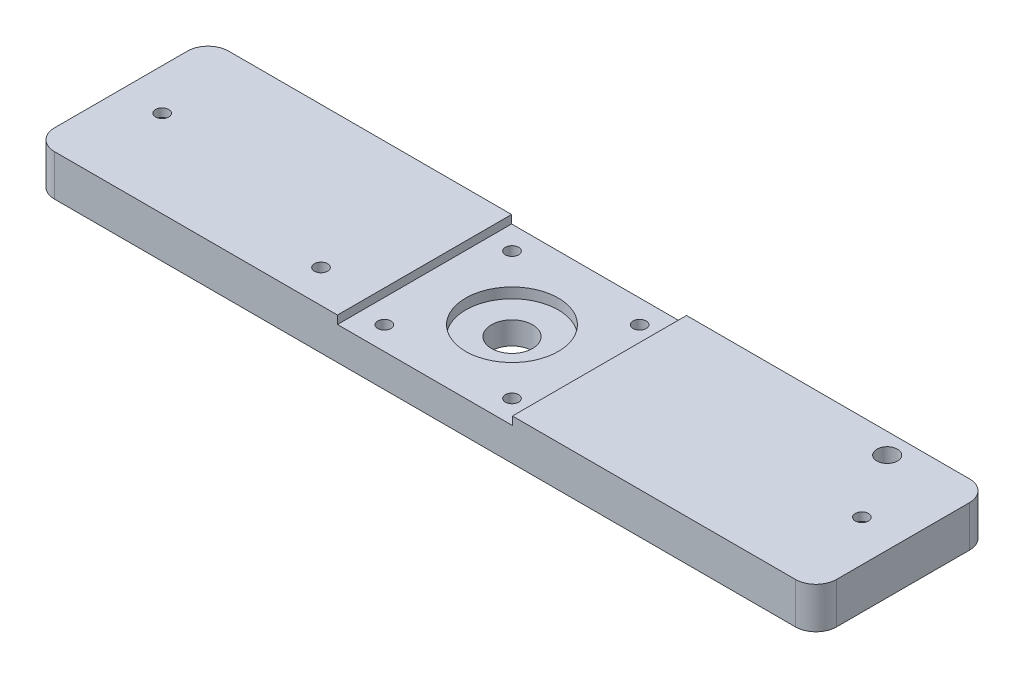
ISO-10303-21;
HEADER;
FILE_DESCRIPTION(('STEP AP214'),'2;1');
FILE_NAME('part.step','',(''),(''),'','','');
FILE_SCHEMA(('AUTOMOTIVE_DESIGN { 1 0 10303 214 1 1 1 1 }'));
ENDSEC;
DATA;
#1=APPLICATION_CONTEXT('core data for automotive mechanical design processes');
#2=APPLICATION_PROTOCOL_DEFINITION('international standard','automotive_design',2000,#1);
#3=PRODUCT_CONTEXT('',#1,'mechanical');
#4=PRODUCT('Part','Part','',(#3));
#5=PRODUCT_RELATED_PRODUCT_CATEGORY('part','',(#4));
#6=PRODUCT_DEFINITION_FORMATION('','',#4);
#7=PRODUCT_DEFINITION_CONTEXT('part definition',#1,'design');
#8=PRODUCT_DEFINITION('design','',#6,#7);
#9=PRODUCT_DEFINITION_SHAPE('','',#8);
#10=(LENGTH_UNIT() NAMED_UNIT(*) SI_UNIT(.MILLI.,.METRE.));
#11=(NAMED_UNIT(*) PLANE_ANGLE_UNIT() SI_UNIT($,.RADIAN.));
#12=(NAMED_UNIT(*) SI_UNIT($,.STERADIAN.) SOLID_ANGLE_UNIT());
#13=UNCERTAINTY_MEASURE_WITH_UNIT(LENGTH_MEASURE(1.E-05),#10,'distance_accuracy_value','');
#14=(GEOMETRIC_REPRESENTATION_CONTEXT(3) GLOBAL_UNCERTAINTY_ASSIGNED_CONTEXT((#13)) GLOBAL_UNIT_ASSIGNED_CONTEXT((#10,
#11,#12)) REPRESENTATION_CONTEXT('',''));
#15=CARTESIAN_POINT('',(0.,0.,0.));
#16=DIRECTION('',(0.,0.,1.));
#17=DIRECTION('',(1.,0.,0.));
#18=AXIS2_PLACEMENT_3D('',#15,#16,#17);
#19=CARTESIAN_POINT('',(0.,10.,0.));
#20=DIRECTION('',(0.,1.,0.));
#21=DIRECTION('',(0.,0.,1.));
#22=AXIS2_PLACEMENT_3D('',#19,#20,#21);
#23=PLANE('',#22);
#24=CARTESIAN_POINT('',(75.,10.,-16.15));
#25=DIRECTION('',(0.,1.,0.));
#26=DIRECTION('',(0.,0.,1.));
#27=AXIS2_PLACEMENT_3D('',#24,#25,#26);
#28=CIRCLE('',#27,2.50000000000001);
#29=CARTESIAN_POINT('',(75.,10.,-13.65));
#30=VERTEX_POINT('',#29);
#31=EDGE_CURVE('E383',#30,#30,#28,.T.);
#32=ORIENTED_EDGE('',*,*,#31,.F.);
#33=EDGE_LOOP('',(#32));
#34=FACE_BOUND('',#33,.T.);
#35=CARTESIAN_POINT('',(85.,10.,0.));
#36=DIRECTION('',(0.,-1.,0.));
#37=DIRECTION('',(0.,0.,-1.));
#38=AXIS2_PLACEMENT_3D('',#35,#36,#37);
#39=CIRCLE('',#38,1.60000000000001);
#40=CARTESIAN_POINT('',(85.,10.,-1.60000000000001));
#41=VERTEX_POINT('',#40);
#42=EDGE_CURVE('E347',#41,#41,#39,.T.);
#43=ORIENTED_EDGE('',*,*,#42,.T.);
#44=EDGE_LOOP('',(#43));
#45=FACE_BOUND('',#44,.T.);
#46=DIRECTION('',(0.,0.,-1.));
#47=VECTOR('',#46,1.);
#48=CARTESIAN_POINT('',(95.,10.,-21.15));
#49=LINE('',#48,#47);
#50=CARTESIAN_POINT('',(95.,10.,16.15));
#51=VERTEX_POINT('',#50);
#52=CARTESIAN_POINT('',(95.,10.,-16.15));
#53=VERTEX_POINT('',#52);
#54=EDGE_CURVE('E178',#51,#53,#49,.T.);
#55=ORIENTED_EDGE('',*,*,#54,.T.);
#56=CARTESIAN_POINT('',(90.,10.,-16.15));
#57=DIRECTION('',(0.,1.,0.));
#58=DIRECTION('',(0.,0.,1.));
#59=AXIS2_PLACEMENT_3D('',#56,#57,#58);
#60=CIRCLE('',#59,5.);
#61=CARTESIAN_POINT('',(90.,10.,-21.15));
#62=VERTEX_POINT('',#61);
#63=EDGE_CURVE('E236',#53,#62,#60,.T.);
#64=ORIENTED_EDGE('',*,*,#63,.T.);
#65=DIRECTION('',(-1.,0.,0.));
#66=VECTOR('',#65,1.);
#67=CARTESIAN_POINT('',(-95.,10.,-21.15));
#68=LINE('',#67,#66);
#69=CARTESIAN_POINT('',(21.25,10.,-21.15));
#70=VERTEX_POINT('',#69);
#71=EDGE_CURVE('E184',#62,#70,#68,.T.);
#72=ORIENTED_EDGE('',*,*,#71,.T.);
#73=DIRECTION('',(0.,0.,-1.));
#74=VECTOR('',#73,1.);
#75=CARTESIAN_POINT('',(21.25,10.,0.));
#76=LINE('',#75,#74);
#77=CARTESIAN_POINT('',(21.25,10.,21.15));
#78=VERTEX_POINT('',#77);
#79=EDGE_CURVE('E150',#78,#70,#76,.T.);
#80=ORIENTED_EDGE('',*,*,#79,.F.);
#81=DIRECTION('',(1.,0.,0.));
#82=VECTOR('',#81,1.);
#83=CARTESIAN_POINT('',(-95.,10.,21.15));
#84=LINE('',#83,#82);
#85=CARTESIAN_POINT('',(90.,10.,21.15));
#86=VERTEX_POINT('',#85);
#87=EDGE_CURVE('E140',#78,#86,#84,.T.);
#88=ORIENTED_EDGE('',*,*,#87,.T.);
#89=CARTESIAN_POINT('',(90.,10.,16.15));
#90=DIRECTION('',(0.,1.,0.));
#91=DIRECTION('',(0.,0.,1.));
#92=AXIS2_PLACEMENT_3D('',#89,#90,#91);
#93=CIRCLE('',#92,5.);
#94=EDGE_CURVE('E233',#86,#51,#93,.T.);
#95=ORIENTED_EDGE('',*,*,#94,.T.);
#96=EDGE_LOOP('',(#55,#64,#72,#80,#88,#95));
#97=FACE_BOUND('',#96,.T.);
#98=ADVANCED_FACE('F40',(#34,#45,#97),#23,.T.);
#99=CARTESIAN_POINT('',(95.,10.,-21.15));
#100=DIRECTION('',(-1.,0.,0.));
#101=DIRECTION('',(0.,0.,1.));
#102=AXIS2_PLACEMENT_3D('',#99,#100,#101);
#103=PLANE('',#102);
#104=DIRECTION('',(0.,0.,-1.));
#105=VECTOR('',#104,1.);
#106=CARTESIAN_POINT('',(95.,0.,-21.15));
#107=LINE('',#106,#105);
#108=CARTESIAN_POINT('',(95.,0.,16.15));
#109=VERTEX_POINT('',#108);
#110=CARTESIAN_POINT('',(95.,0.,-16.15));
#111=VERTEX_POINT('',#110);
#112=EDGE_CURVE('E177',#109,#111,#107,.T.);
#113=ORIENTED_EDGE('',*,*,#112,.T.);
#114=DIRECTION('',(0.,-1.,0.));
#115=VECTOR('',#114,1.);
#116=CARTESIAN_POINT('',(95.,10.,-16.15));
#117=LINE('',#116,#115);
#118=EDGE_CURVE('E230',#111,#53,#117,.F.);
#119=ORIENTED_EDGE('',*,*,#118,.T.);
#120=ORIENTED_EDGE('',*,*,#54,.F.);
#121=DIRECTION('',(0.,-1.,0.));
#122=VECTOR('',#121,1.);
#123=CARTESIAN_POINT('',(95.,10.,16.15));
#124=LINE('',#123,#122);
#125=EDGE_CURVE('E226',#51,#109,#124,.T.);
#126=ORIENTED_EDGE('',*,*,#125,.T.);
#127=EDGE_LOOP('',(#113,#119,#120,#126));
#128=FACE_BOUND('',#127,.T.);
#129=ADVANCED_FACE('F277',(#128),#103,.F.);
#130=CARTESIAN_POINT('',(-95.,10.,-21.15));
#131=DIRECTION('',(0.,0.,1.));
#132=DIRECTION('',(1.,0.,0.));
#133=AXIS2_PLACEMENT_3D('',#130,#131,#132);
#134=PLANE('',#133);
#135=ORIENTED_EDGE('',*,*,#71,.F.);
#136=DIRECTION('',(0.,-1.,0.));
#137=VECTOR('',#136,1.);
#138=CARTESIAN_POINT('',(90.,10.,-21.15));
#139=LINE('',#138,#137);
#140=CARTESIAN_POINT('',(90.,0.,-21.15));
#141=VERTEX_POINT('',#140);
#142=EDGE_CURVE('E210',#62,#141,#139,.T.);
#143=ORIENTED_EDGE('',*,*,#142,.T.);
#144=DIRECTION('',(-1.,0.,0.));
#145=VECTOR('',#144,1.);
#146=CARTESIAN_POINT('',(-95.,0.,-21.15));
#147=LINE('',#146,#145);
#148=CARTESIAN_POINT('',(-90.,0.,-21.15));
#149=VERTEX_POINT('',#148);
#150=EDGE_CURVE('E193',#141,#149,#147,.T.);
#151=ORIENTED_EDGE('',*,*,#150,.T.);
#152=DIRECTION('',(0.,-1.,0.));
#153=VECTOR('',#152,1.);
#154=CARTESIAN_POINT('',(-90.,10.,-21.15));
#155=LINE('',#154,#153);
#156=CARTESIAN_POINT('',(-90.,10.,-21.15));
#157=VERTEX_POINT('',#156);
#158=EDGE_CURVE('E207',#149,#157,#155,.F.);
#159=ORIENTED_EDGE('',*,*,#158,.T.);
#160=CARTESIAN_POINT('',(-21.25,10.,-21.15));
#161=VERTEX_POINT('',#160);
#162=EDGE_CURVE('E182',#161,#157,#68,.T.);
#163=ORIENTED_EDGE('',*,*,#162,.F.);
#164=DIRECTION('',(0.,-1.,0.));
#165=VECTOR('',#164,1.);
#166=CARTESIAN_POINT('',(-21.25,10.,-21.15));
#167=LINE('',#166,#165);
#168=CARTESIAN_POINT('',(-21.25,8.,-21.15));
#169=VERTEX_POINT('',#168);
#170=EDGE_CURVE('E148',#161,#169,#167,.T.);
#171=ORIENTED_EDGE('',*,*,#170,.T.);
#172=DIRECTION('',(-1.,0.,0.));
#173=VECTOR('',#172,1.);
#174=CARTESIAN_POINT('',(-95.,8.,-21.15));
#175=LINE('',#174,#173);
#176=CARTESIAN_POINT('',(21.25,8.,-21.15));
#177=VERTEX_POINT('',#176);
#178=EDGE_CURVE('E174',#177,#169,#175,.T.);
#179=ORIENTED_EDGE('',*,*,#178,.F.);
#180=DIRECTION('',(0.,1.,0.));
#181=VECTOR('',#180,1.);
#182=CARTESIAN_POINT('',(21.25,10.,-21.15));
#183=LINE('',#182,#181);
#184=EDGE_CURVE('E170',#177,#70,#183,.T.);
#185=ORIENTED_EDGE('',*,*,#184,.T.);
#186=EDGE_LOOP('',(#135,#143,#151,#159,#163,#171,#179,#185));
#187=FACE_BOUND('',#186,.T.);
#188=ADVANCED_FACE('F284',(#187),#134,.F.);
#189=CARTESIAN_POINT('',(-95.,10.,-21.15));
#190=DIRECTION('',(1.,0.,0.));
#191=DIRECTION('',(0.,0.,-1.));
#192=AXIS2_PLACEMENT_3D('',#189,#190,#191);
#193=PLANE('',#192);
#194=DIRECTION('',(0.,0.,1.));
#195=VECTOR('',#194,1.);
#196=CARTESIAN_POINT('',(-95.,0.,-21.15));
#197=LINE('',#196,#195);
#198=CARTESIAN_POINT('',(-95.,0.,-16.15));
#199=VERTEX_POINT('',#198);
#200=CARTESIAN_POINT('',(-95.,0.,16.15));
#201=VERTEX_POINT('',#200);
#202=EDGE_CURVE('E197',#199,#201,#197,.T.);
#203=ORIENTED_EDGE('',*,*,#202,.T.);
#204=DIRECTION('',(0.,-1.,0.));
#205=VECTOR('',#204,1.);
#206=CARTESIAN_POINT('',(-95.,10.,16.15));
#207=LINE('',#206,#205);
#208=CARTESIAN_POINT('',(-95.,10.,16.15));
#209=VERTEX_POINT('',#208);
#210=EDGE_CURVE('E56',#201,#209,#207,.F.);
#211=ORIENTED_EDGE('',*,*,#210,.T.);
#212=DIRECTION('',(0.,0.,1.));
#213=VECTOR('',#212,1.);
#214=CARTESIAN_POINT('',(-95.,10.,-21.15));
#215=LINE('',#214,#213);
#216=CARTESIAN_POINT('',(-95.,10.,-16.15));
#217=VERTEX_POINT('',#216);
#218=EDGE_CURVE('E187',#217,#209,#215,.T.);
#219=ORIENTED_EDGE('',*,*,#218,.F.);
#220=DIRECTION('',(0.,-1.,0.));
#221=VECTOR('',#220,1.);
#222=CARTESIAN_POINT('',(-95.,10.,-16.15));
#223=LINE('',#222,#221);
#224=EDGE_CURVE('E245',#217,#199,#223,.T.);
#225=ORIENTED_EDGE('',*,*,#224,.T.);
#226=EDGE_LOOP('',(#203,#211,#219,#225));
#227=FACE_BOUND('',#226,.T.);
#228=ADVANCED_FACE('F259',(#227),#193,.F.);
#229=CARTESIAN_POINT('',(-95.,10.,21.15));
#230=DIRECTION('',(0.,0.,-1.));
#231=DIRECTION('',(-1.,0.,0.));
#232=AXIS2_PLACEMENT_3D('',#229,#230,#231);
#233=PLANE('',#232);
#234=DIRECTION('',(1.,0.,0.));
#235=VECTOR('',#234,1.);
#236=CARTESIAN_POINT('',(-95.,0.,21.15));
#237=LINE('',#236,#235);
#238=CARTESIAN_POINT('',(-90.,0.,21.15));
#239=VERTEX_POINT('',#238);
#240=CARTESIAN_POINT('',(90.,0.,21.15));
#241=VERTEX_POINT('',#240);
#242=EDGE_CURVE('E183',#239,#241,#237,.T.);
#243=ORIENTED_EDGE('',*,*,#242,.T.);
#244=DIRECTION('',(0.,-1.,0.));
#245=VECTOR('',#244,1.);
#246=CARTESIAN_POINT('',(90.,10.,21.15));
#247=LINE('',#246,#245);
#248=EDGE_CURVE('E242',#241,#86,#247,.F.);
#249=ORIENTED_EDGE('',*,*,#248,.T.);
#250=ORIENTED_EDGE('',*,*,#87,.F.);
#251=DIRECTION('',(0.,-1.,0.));
#252=VECTOR('',#251,1.);
#253=CARTESIAN_POINT('',(21.25,10.,21.15));
#254=LINE('',#253,#252);
#255=CARTESIAN_POINT('',(21.25,8.,21.15));
#256=VERTEX_POINT('',#255);
#257=EDGE_CURVE('E162',#78,#256,#254,.T.);
#258=ORIENTED_EDGE('',*,*,#257,.T.);
#259=DIRECTION('',(1.,0.,0.));
#260=VECTOR('',#259,1.);
#261=CARTESIAN_POINT('',(-95.,8.,21.15));
#262=LINE('',#261,#260);
#263=CARTESIAN_POINT('',(-21.25,8.,21.15));
#264=VERTEX_POINT('',#263);
#265=EDGE_CURVE('E156',#264,#256,#262,.T.);
#266=ORIENTED_EDGE('',*,*,#265,.F.);
#267=DIRECTION('',(0.,1.,0.));
#268=VECTOR('',#267,1.);
#269=CARTESIAN_POINT('',(-21.25,10.,21.15));
#270=LINE('',#269,#268);
#271=CARTESIAN_POINT('',(-21.25,10.,21.15));
#272=VERTEX_POINT('',#271);
#273=EDGE_CURVE('E145',#264,#272,#270,.T.);
#274=ORIENTED_EDGE('',*,*,#273,.T.);
#275=CARTESIAN_POINT('',(-90.,10.,21.15));
#276=VERTEX_POINT('',#275);
#277=EDGE_CURVE('E129',#276,#272,#84,.T.);
#278=ORIENTED_EDGE('',*,*,#277,.F.);
#279=DIRECTION('',(0.,-1.,0.));
#280=VECTOR('',#279,1.);
#281=CARTESIAN_POINT('',(-90.,10.,21.15));
#282=LINE('',#281,#280);
#283=EDGE_CURVE('E239',#276,#239,#282,.T.);
#284=ORIENTED_EDGE('',*,*,#283,.T.);
#285=EDGE_LOOP('',(#243,#249,#250,#258,#266,#274,#278,#284));
#286=FACE_BOUND('',#285,.T.);
#287=ADVANCED_FACE('F154',(#286),#233,.F.);
#288=CARTESIAN_POINT('',(-33.25,10.,13.15));
#289=DIRECTION('',(0.,1.,0.));
#290=DIRECTION('',(0.,0.,1.));
#291=AXIS2_PLACEMENT_3D('',#288,#289,#290);
#292=CIRCLE('',#291,1.6);
#293=CARTESIAN_POINT('',(-33.25,10.,14.75));
#294=VERTEX_POINT('',#293);
#295=EDGE_CURVE('E378',#294,#294,#292,.T.);
#296=ORIENTED_EDGE('',*,*,#295,.F.);
#297=EDGE_LOOP('',(#296));
#298=FACE_BOUND('',#297,.T.);
#299=CARTESIAN_POINT('',(-85.,10.,0.));
#300=DIRECTION('',(0.,-1.,0.));
#301=DIRECTION('',(0.,0.,-1.));
#302=AXIS2_PLACEMENT_3D('',#299,#300,#301);
#303=CIRCLE('',#302,1.60000000000001);
#304=CARTESIAN_POINT('',(-85.,10.,-1.60000000000001));
#305=VERTEX_POINT('',#304);
#306=EDGE_CURVE('E332',#305,#305,#303,.T.);
#307=ORIENTED_EDGE('',*,*,#306,.T.);
#308=EDGE_LOOP('',(#307));
#309=FACE_BOUND('',#308,.T.);
#310=ORIENTED_EDGE('',*,*,#218,.T.);
#311=CARTESIAN_POINT('',(-90.,10.,16.15));
#312=DIRECTION('',(0.,1.,0.));
#313=DIRECTION('',(0.,0.,1.));
#314=AXIS2_PLACEMENT_3D('',#311,#312,#313);
#315=CIRCLE('',#314,5.);
#316=EDGE_CURVE('E11',#209,#276,#315,.T.);
#317=ORIENTED_EDGE('',*,*,#316,.T.);
#318=ORIENTED_EDGE('',*,*,#277,.T.);
#319=DIRECTION('',(0.,0.,1.));
#320=VECTOR('',#319,1.);
#321=CARTESIAN_POINT('',(-21.25,10.,0.));
#322=LINE('',#321,#320);
#323=EDGE_CURVE('E132',#161,#272,#322,.T.);
#324=ORIENTED_EDGE('',*,*,#323,.F.);
#325=ORIENTED_EDGE('',*,*,#162,.T.);
#326=CARTESIAN_POINT('',(-90.,10.,-16.15));
#327=DIRECTION('',(0.,1.,0.));
#328=DIRECTION('',(0.,0.,1.));
#329=AXIS2_PLACEMENT_3D('',#326,#327,#328);
#330=CIRCLE('',#329,5.);
#331=EDGE_CURVE('E49',#157,#217,#330,.T.);
#332=ORIENTED_EDGE('',*,*,#331,.T.);
#333=EDGE_LOOP('',(#310,#317,#318,#324,#325,#332));
#334=FACE_BOUND('',#333,.T.);
#335=ADVANCED_FACE('F131',(#298,#309,#334),#23,.T.);
#336=CARTESIAN_POINT('',(0.,0.,0.));
#337=DIRECTION('',(0.,1.,0.));
#338=DIRECTION('',(0.,0.,1.));
#339=AXIS2_PLACEMENT_3D('',#336,#337,#338);
#340=PLANE('',#339);
#341=CARTESIAN_POINT('',(75.,0.,-16.15));
#342=DIRECTION('',(0.,1.,0.));
#343=DIRECTION('',(0.,0.,1.));
#344=AXIS2_PLACEMENT_3D('',#341,#342,#343);
#345=CIRCLE('',#344,2.50000000000001);
#346=CARTESIAN_POINT('',(75.,0.,-13.65));
#347=VERTEX_POINT('',#346);
#348=EDGE_CURVE('E382',#347,#347,#345,.T.);
#349=ORIENTED_EDGE('',*,*,#348,.T.);
#350=EDGE_LOOP('',(#349));
#351=FACE_BOUND('',#350,.T.);
#352=CARTESIAN_POINT('',(-33.25,0.,13.15));
#353=DIRECTION('',(0.,1.,0.));
#354=DIRECTION('',(0.,0.,1.));
#355=AXIS2_PLACEMENT_3D('',#352,#353,#354);
#356=CIRCLE('',#355,1.6);
#357=CARTESIAN_POINT('',(-33.25,0.,14.75));
#358=VERTEX_POINT('',#357);
#359=EDGE_CURVE('E368',#358,#358,#356,.F.);
#360=ORIENTED_EDGE('',*,*,#359,.F.);
#361=EDGE_LOOP('',(#360));
#362=FACE_BOUND('',#361,.T.);
#363=CARTESIAN_POINT('',(-15.5,0.,-15.5));
#364=DIRECTION('',(0.,1.,0.));
#365=DIRECTION('',(0.,0.,1.));
#366=AXIS2_PLACEMENT_3D('',#363,#364,#365);
#367=CIRCLE('',#366,1.6);
#368=CARTESIAN_POINT('',(-15.5,0.,-13.9));
#369=VERTEX_POINT('',#368);
#370=EDGE_CURVE('E363',#369,#369,#367,.T.);
#371=ORIENTED_EDGE('',*,*,#370,.T.);
#372=EDGE_LOOP('',(#371));
#373=FACE_BOUND('',#372,.T.);
#374=CARTESIAN_POINT('',(-15.5,0.,15.5));
#375=DIRECTION('',(0.,1.,0.));
#376=DIRECTION('',(0.,0.,1.));
#377=AXIS2_PLACEMENT_3D('',#374,#375,#376);
#378=CIRCLE('',#377,1.6);
#379=CARTESIAN_POINT('',(-15.5,0.,17.1));
#380=VERTEX_POINT('',#379);
#381=EDGE_CURVE('E367',#380,#380,#378,.T.);
#382=ORIENTED_EDGE('',*,*,#381,.T.);
#383=EDGE_LOOP('',(#382));
#384=FACE_BOUND('',#383,.T.);
#385=CARTESIAN_POINT('',(15.5,0.,15.5));
#386=DIRECTION('',(0.,1.,0.));
#387=DIRECTION('',(0.,0.,1.));
#388=AXIS2_PLACEMENT_3D('',#385,#386,#387);
#389=CIRCLE('',#388,1.6);
#390=CARTESIAN_POINT('',(15.5,0.,17.1));
#391=VERTEX_POINT('',#390);
#392=EDGE_CURVE('E362',#391,#391,#389,.T.);
#393=ORIENTED_EDGE('',*,*,#392,.T.);
#394=EDGE_LOOP('',(#393));
#395=FACE_BOUND('',#394,.T.);
#396=CARTESIAN_POINT('',(15.5,0.,-15.5));
#397=DIRECTION('',(0.,1.,0.));
#398=DIRECTION('',(0.,0.,1.));
#399=AXIS2_PLACEMENT_3D('',#396,#397,#398);
#400=CIRCLE('',#399,1.6);
#401=CARTESIAN_POINT('',(15.5,0.,-13.9));
#402=VERTEX_POINT('',#401);
#403=EDGE_CURVE('E355',#402,#402,#400,.T.);
#404=ORIENTED_EDGE('',*,*,#403,.T.);
#405=EDGE_LOOP('',(#404));
#406=FACE_BOUND('',#405,.T.);
#407=CARTESIAN_POINT('',(-85.,0.,0.));
#408=DIRECTION('',(0.,-1.,0.));
#409=DIRECTION('',(0.,0.,-1.));
#410=AXIS2_PLACEMENT_3D('',#407,#408,#409);
#411=CIRCLE('',#410,4.025);
#412=CARTESIAN_POINT('',(-85.,0.,-4.025));
#413=VERTEX_POINT('',#412);
#414=EDGE_CURVE('E336',#413,#413,#411,.T.);
#415=ORIENTED_EDGE('',*,*,#414,.F.);
#416=EDGE_LOOP('',(#415));
#417=FACE_BOUND('',#416,.T.);
#418=CARTESIAN_POINT('',(85.,0.,0.));
#419=DIRECTION('',(0.,-1.,0.));
#420=DIRECTION('',(0.,0.,1.));
#421=AXIS2_PLACEMENT_3D('',#418,#419,#420);
#422=CIRCLE('',#421,4.025);
#423=CARTESIAN_POINT('',(85.,0.,4.025));
#424=VERTEX_POINT('',#423);
#425=EDGE_CURVE('E327',#424,#424,#422,.T.);
#426=ORIENTED_EDGE('',*,*,#425,.F.);
#427=EDGE_LOOP('',(#426));
#428=FACE_BOUND('',#427,.T.);
#429=CARTESIAN_POINT('',(0.,0.,0.));
#430=DIRECTION('',(0.,1.,0.));
#431=DIRECTION('',(0.,0.,1.));
#432=AXIS2_PLACEMENT_3D('',#429,#430,#431);
#433=CIRCLE('',#432,5.);
#434=CARTESIAN_POINT('',(0.,0.,5.));
#435=VERTEX_POINT('',#434);
#436=EDGE_CURVE('E304',#435,#435,#433,.T.);
#437=ORIENTED_EDGE('',*,*,#436,.T.);
#438=EDGE_LOOP('',(#437));
#439=FACE_BOUND('',#438,.T.);
#440=ORIENTED_EDGE('',*,*,#150,.F.);
#441=CARTESIAN_POINT('',(90.,0.,-16.15));
#442=DIRECTION('',(0.,1.,0.));
#443=DIRECTION('',(0.,0.,1.));
#444=AXIS2_PLACEMENT_3D('',#441,#442,#443);
#445=CIRCLE('',#444,5.);
#446=EDGE_CURVE('E223',#141,#111,#445,.F.);
#447=ORIENTED_EDGE('',*,*,#446,.T.);
#448=ORIENTED_EDGE('',*,*,#112,.F.);
#449=CARTESIAN_POINT('',(90.,0.,16.15));
#450=DIRECTION('',(0.,1.,0.));
#451=DIRECTION('',(0.,0.,1.));
#452=AXIS2_PLACEMENT_3D('',#449,#450,#451);
#453=CIRCLE('',#452,5.);
#454=EDGE_CURVE('E220',#109,#241,#453,.F.);
#455=ORIENTED_EDGE('',*,*,#454,.T.);
#456=ORIENTED_EDGE('',*,*,#242,.F.);
#457=CARTESIAN_POINT('',(-90.,0.,16.15));
#458=DIRECTION('',(0.,1.,0.));
#459=DIRECTION('',(0.,0.,1.));
#460=AXIS2_PLACEMENT_3D('',#457,#458,#459);
#461=CIRCLE('',#460,5.);
#462=EDGE_CURVE('E217',#239,#201,#461,.F.);
#463=ORIENTED_EDGE('',*,*,#462,.T.);
#464=ORIENTED_EDGE('',*,*,#202,.F.);
#465=CARTESIAN_POINT('',(-90.,0.,-16.15));
#466=DIRECTION('',(0.,1.,0.));
#467=DIRECTION('',(0.,0.,1.));
#468=AXIS2_PLACEMENT_3D('',#465,#466,#467);
#469=CIRCLE('',#468,5.);
#470=EDGE_CURVE('E214',#199,#149,#469,.F.);
#471=ORIENTED_EDGE('',*,*,#470,.T.);
#472=EDGE_LOOP('',(#440,#447,#448,#455,#456,#463,#464,#471));
#473=FACE_BOUND('',#472,.T.);
#474=ADVANCED_FACE('F262',(#351,#362,#373,#384,#395,#406,#417,#428,#439,#473),#340,.F.);
#475=CARTESIAN_POINT('',(0.,8.,0.));
#476=DIRECTION('',(0.,1.,0.));
#477=DIRECTION('',(0.,0.,1.));
#478=AXIS2_PLACEMENT_3D('',#475,#476,#477);
#479=PLANE('',#478);
#480=CARTESIAN_POINT('',(0.,8.,0.));
#481=DIRECTION('',(0.,1.,0.));
#482=DIRECTION('',(0.,0.,1.));
#483=AXIS2_PLACEMENT_3D('',#480,#481,#482);
#484=CIRCLE('',#483,11.25);
#485=CARTESIAN_POINT('',(0.,8.,11.25));
#486=VERTEX_POINT('',#485);
#487=EDGE_CURVE('E299',#486,#486,#484,.T.);
#488=ORIENTED_EDGE('',*,*,#487,.F.);
#489=EDGE_LOOP('',(#488));
#490=FACE_BOUND('',#489,.T.);
#491=CARTESIAN_POINT('',(-15.5,8.,15.5));
#492=DIRECTION('',(0.,1.,0.));
#493=DIRECTION('',(0.,0.,-1.));
#494=AXIS2_PLACEMENT_3D('',#491,#492,#493);
#495=CIRCLE('',#494,1.6);
#496=CARTESIAN_POINT('',(-15.5,8.,13.9));
#497=VERTEX_POINT('',#496);
#498=EDGE_CURVE('E308',#497,#497,#495,.T.);
#499=ORIENTED_EDGE('',*,*,#498,.F.);
#500=EDGE_LOOP('',(#499));
#501=FACE_BOUND('',#500,.T.);
#502=CARTESIAN_POINT('',(15.5,8.,15.5));
#503=DIRECTION('',(0.,1.,0.));
#504=DIRECTION('',(0.,0.,1.));
#505=AXIS2_PLACEMENT_3D('',#502,#503,#504);
#506=CIRCLE('',#505,1.6);
#507=CARTESIAN_POINT('',(15.5,8.,17.1));
#508=VERTEX_POINT('',#507);
#509=EDGE_CURVE('E312',#508,#508,#506,.T.);
#510=ORIENTED_EDGE('',*,*,#509,.F.);
#511=EDGE_LOOP('',(#510));
#512=FACE_BOUND('',#511,.T.);
#513=CARTESIAN_POINT('',(15.5,8.,-15.5));
#514=DIRECTION('',(0.,1.,0.));
#515=DIRECTION('',(0.,0.,-1.));
#516=AXIS2_PLACEMENT_3D('',#513,#514,#515);
#517=CIRCLE('',#516,1.6);
#518=CARTESIAN_POINT('',(15.5,8.,-17.1));
#519=VERTEX_POINT('',#518);
#520=EDGE_CURVE('E296',#519,#519,#517,.T.);
#521=ORIENTED_EDGE('',*,*,#520,.F.);
#522=EDGE_LOOP('',(#521));
#523=FACE_BOUND('',#522,.T.);
#524=CARTESIAN_POINT('',(-15.5,8.,-15.5));
#525=DIRECTION('',(0.,1.,0.));
#526=DIRECTION('',(0.,0.,1.));
#527=AXIS2_PLACEMENT_3D('',#524,#525,#526);
#528=CIRCLE('',#527,1.6);
#529=CARTESIAN_POINT('',(-15.5,8.,-13.9));
#530=VERTEX_POINT('',#529);
#531=EDGE_CURVE('E293',#530,#530,#528,.T.);
#532=ORIENTED_EDGE('',*,*,#531,.F.);
#533=EDGE_LOOP('',(#532));
#534=FACE_BOUND('',#533,.T.);
#535=ORIENTED_EDGE('',*,*,#178,.T.);
#536=DIRECTION('',(0.,0.,1.));
#537=VECTOR('',#536,1.);
#538=CARTESIAN_POINT('',(-21.25,8.,-24.8385682721788));
#539=LINE('',#538,#537);
#540=EDGE_CURVE('E158',#169,#264,#539,.T.);
#541=ORIENTED_EDGE('',*,*,#540,.T.);
#542=ORIENTED_EDGE('',*,*,#265,.T.);
#543=DIRECTION('',(0.,0.,-1.));
#544=VECTOR('',#543,1.);
#545=CARTESIAN_POINT('',(21.25,8.,-24.8385682721788));
#546=LINE('',#545,#544);
#547=EDGE_CURVE('E164',#256,#177,#546,.T.);
#548=ORIENTED_EDGE('',*,*,#547,.T.);
#549=EDGE_LOOP('',(#535,#541,#542,#548));
#550=FACE_BOUND('',#549,.T.);
#551=ADVANCED_FACE('F291',(#490,#501,#512,#523,#534,#550),#479,.T.);
#552=CARTESIAN_POINT('',(21.25,8.,-24.8385682721788));
#553=DIRECTION('',(1.,0.,0.));
#554=DIRECTION('',(0.,0.,-1.));
#555=AXIS2_PLACEMENT_3D('',#552,#553,#554);
#556=PLANE('',#555);
#557=ORIENTED_EDGE('',*,*,#547,.F.);
#558=ORIENTED_EDGE('',*,*,#257,.F.);
#559=ORIENTED_EDGE('',*,*,#79,.T.);
#560=ORIENTED_EDGE('',*,*,#184,.F.);
#561=EDGE_LOOP('',(#557,#558,#559,#560));
#562=FACE_BOUND('',#561,.T.);
#563=ADVANCED_FACE('F289',(#562),#556,.F.);
#564=CARTESIAN_POINT('',(-21.25,8.,-24.8385682721788));
#565=DIRECTION('',(-1.,0.,0.));
#566=DIRECTION('',(0.,0.,1.));
#567=AXIS2_PLACEMENT_3D('',#564,#565,#566);
#568=PLANE('',#567);
#569=ORIENTED_EDGE('',*,*,#323,.T.);
#570=ORIENTED_EDGE('',*,*,#273,.F.);
#571=ORIENTED_EDGE('',*,*,#540,.F.);
#572=ORIENTED_EDGE('',*,*,#170,.F.);
#573=EDGE_LOOP('',(#569,#570,#571,#572));
#574=FACE_BOUND('',#573,.T.);
#575=ADVANCED_FACE('F143',(#574),#568,.F.);
#576=CARTESIAN_POINT('',(-15.5,5.5,-15.5));
#577=DIRECTION('',(0.,1.,0.));
#578=DIRECTION('',(0.,0.,1.));
#579=AXIS2_PLACEMENT_3D('',#576,#577,#578);
#580=CYLINDRICAL_SURFACE('',#579,1.6);
#581=ORIENTED_EDGE('',*,*,#531,.T.);
#582=EDGE_LOOP('',(#581));
#583=FACE_BOUND('',#582,.T.);
#584=ORIENTED_EDGE('',*,*,#370,.F.);
#585=EDGE_LOOP('',(#584));
#586=FACE_BOUND('',#585,.T.);
#587=ADVANCED_FACE('F460',(#583,#586),#580,.F.);
#588=CARTESIAN_POINT('',(15.5,5.5,-15.5));
#589=DIRECTION('',(0.,1.,0.));
#590=DIRECTION('',(0.,0.,1.));
#591=AXIS2_PLACEMENT_3D('',#588,#589,#590);
#592=CYLINDRICAL_SURFACE('',#591,1.6);
#593=ORIENTED_EDGE('',*,*,#520,.T.);
#594=EDGE_LOOP('',(#593));
#595=FACE_BOUND('',#594,.T.);
#596=ORIENTED_EDGE('',*,*,#403,.F.);
#597=EDGE_LOOP('',(#596));
#598=FACE_BOUND('',#597,.T.);
#599=ADVANCED_FACE('F463',(#595,#598),#592,.F.);
#600=CARTESIAN_POINT('',(15.5,5.5,15.5));
#601=DIRECTION('',(0.,1.,0.));
#602=DIRECTION('',(0.,0.,1.));
#603=AXIS2_PLACEMENT_3D('',#600,#601,#602);
#604=CYLINDRICAL_SURFACE('',#603,1.6);
#605=ORIENTED_EDGE('',*,*,#509,.T.);
#606=EDGE_LOOP('',(#605));
#607=FACE_BOUND('',#606,.T.);
#608=ORIENTED_EDGE('',*,*,#392,.F.);
#609=EDGE_LOOP('',(#608));
#610=FACE_BOUND('',#609,.T.);
#611=ADVANCED_FACE('F490',(#607,#610),#604,.F.);
#612=CARTESIAN_POINT('',(-15.5,5.5,15.5));
#613=DIRECTION('',(0.,1.,0.));
#614=DIRECTION('',(0.,0.,1.));
#615=AXIS2_PLACEMENT_3D('',#612,#613,#614);
#616=CYLINDRICAL_SURFACE('',#615,1.6);
#617=ORIENTED_EDGE('',*,*,#498,.T.);
#618=EDGE_LOOP('',(#617));
#619=FACE_BOUND('',#618,.T.);
#620=ORIENTED_EDGE('',*,*,#381,.F.);
#621=EDGE_LOOP('',(#620));
#622=FACE_BOUND('',#621,.T.);
#623=ADVANCED_FACE('F445',(#619,#622),#616,.F.);
#624=CARTESIAN_POINT('',(0.,5.5,0.));
#625=DIRECTION('',(0.,1.,0.));
#626=DIRECTION('',(0.,0.,1.));
#627=AXIS2_PLACEMENT_3D('',#624,#625,#626);
#628=CYLINDRICAL_SURFACE('',#627,11.25);
#629=CARTESIAN_POINT('',(0.,5.5,0.));
#630=DIRECTION('',(0.,1.,0.));
#631=DIRECTION('',(0.,0.,1.));
#632=AXIS2_PLACEMENT_3D('',#629,#630,#631);
#633=CIRCLE('',#632,11.25);
#634=CARTESIAN_POINT('',(0.,5.5,11.25));
#635=VERTEX_POINT('',#634);
#636=EDGE_CURVE('E303',#635,#635,#633,.T.);
#637=ORIENTED_EDGE('',*,*,#636,.F.);
#638=EDGE_LOOP('',(#637));
#639=FACE_BOUND('',#638,.T.);
#640=ORIENTED_EDGE('',*,*,#487,.T.);
#641=EDGE_LOOP('',(#640));
#642=FACE_BOUND('',#641,.T.);
#643=ADVANCED_FACE('F439',(#639,#642),#628,.F.);
#644=CARTESIAN_POINT('',(0.,5.5,0.));
#645=DIRECTION('',(0.,1.,0.));
#646=DIRECTION('',(0.,0.,1.));
#647=AXIS2_PLACEMENT_3D('',#644,#645,#646);
#648=PLANE('',#647);
#649=CARTESIAN_POINT('',(0.,5.5,0.));
#650=DIRECTION('',(0.,1.,0.));
#651=DIRECTION('',(0.,0.,1.));
#652=AXIS2_PLACEMENT_3D('',#649,#650,#651);
#653=CIRCLE('',#652,5.);
#654=CARTESIAN_POINT('',(0.,5.5,5.));
#655=VERTEX_POINT('',#654);
#656=EDGE_CURVE('E319',#655,#655,#653,.T.);
#657=ORIENTED_EDGE('',*,*,#656,.F.);
#658=EDGE_LOOP('',(#657));
#659=FACE_BOUND('',#658,.T.);
#660=ORIENTED_EDGE('',*,*,#636,.T.);
#661=EDGE_LOOP('',(#660));
#662=FACE_BOUND('',#661,.T.);
#663=ADVANCED_FACE('F433',(#659,#662),#648,.T.);
#664=CARTESIAN_POINT('',(0.,0.,0.));
#665=DIRECTION('',(0.,1.,0.));
#666=DIRECTION('',(0.,0.,1.));
#667=AXIS2_PLACEMENT_3D('',#664,#665,#666);
#668=CYLINDRICAL_SURFACE('',#667,5.);
#669=ORIENTED_EDGE('',*,*,#436,.F.);
#670=EDGE_LOOP('',(#669));
#671=FACE_BOUND('',#670,.T.);
#672=ORIENTED_EDGE('',*,*,#656,.T.);
#673=EDGE_LOOP('',(#672));
#674=FACE_BOUND('',#673,.T.);
#675=ADVANCED_FACE('F422',(#671,#674),#668,.F.);
#676=CARTESIAN_POINT('',(85.,8.,0.));
#677=DIRECTION('',(0.,-1.,0.));
#678=DIRECTION('',(0.,0.,-1.));
#679=AXIS2_PLACEMENT_3D('',#676,#677,#678);
#680=CYLINDRICAL_SURFACE('',#679,4.025);
#681=CARTESIAN_POINT('',(85.,8.,0.));
#682=DIRECTION('',(0.,-1.,0.));
#683=DIRECTION('',(0.,0.,1.));
#684=AXIS2_PLACEMENT_3D('',#681,#682,#683);
#685=CIRCLE('',#684,4.025);
#686=CARTESIAN_POINT('',(85.,8.,4.025));
#687=VERTEX_POINT('',#686);
#688=EDGE_CURVE('E331',#687,#687,#685,.T.);
#689=ORIENTED_EDGE('',*,*,#688,.F.);
#690=EDGE_LOOP('',(#689));
#691=FACE_BOUND('',#690,.T.);
#692=ORIENTED_EDGE('',*,*,#425,.T.);
#693=EDGE_LOOP('',(#692));
#694=FACE_BOUND('',#693,.T.);
#695=ADVANCED_FACE('F416',(#691,#694),#680,.F.);
#696=CARTESIAN_POINT('',(85.,8.,0.));
#697=DIRECTION('',(0.,1.,0.));
#698=DIRECTION('',(0.,0.,1.));
#699=AXIS2_PLACEMENT_3D('',#696,#697,#698);
#700=PLANE('',#699);
#701=CARTESIAN_POINT('',(85.,8.,0.));
#702=DIRECTION('',(0.,-1.,0.));
#703=DIRECTION('',(0.,0.,-1.));
#704=AXIS2_PLACEMENT_3D('',#701,#702,#703);
#705=CIRCLE('',#704,1.60000000000001);
#706=CARTESIAN_POINT('',(85.,8.,-1.60000000000001));
#707=VERTEX_POINT('',#706);
#708=EDGE_CURVE('E351',#707,#707,#705,.T.);
#709=ORIENTED_EDGE('',*,*,#708,.F.);
#710=EDGE_LOOP('',(#709));
#711=FACE_BOUND('',#710,.T.);
#712=ORIENTED_EDGE('',*,*,#688,.T.);
#713=EDGE_LOOP('',(#712));
#714=FACE_BOUND('',#713,.T.);
#715=ADVANCED_FACE('F412',(#711,#714),#700,.F.);
#716=CARTESIAN_POINT('',(-85.,8.,0.));
#717=DIRECTION('',(0.,-1.,0.));
#718=DIRECTION('',(0.,0.,-1.));
#719=AXIS2_PLACEMENT_3D('',#716,#717,#718);
#720=CYLINDRICAL_SURFACE('',#719,4.025);
#721=CARTESIAN_POINT('',(-85.,8.,0.));
#722=DIRECTION('',(0.,-1.,0.));
#723=DIRECTION('',(0.,0.,-1.));
#724=AXIS2_PLACEMENT_3D('',#721,#722,#723);
#725=CIRCLE('',#724,4.025);
#726=CARTESIAN_POINT('',(-85.,8.,-4.025));
#727=VERTEX_POINT('',#726);
#728=EDGE_CURVE('E323',#727,#727,#725,.T.);
#729=ORIENTED_EDGE('',*,*,#728,.F.);
#730=EDGE_LOOP('',(#729));
#731=FACE_BOUND('',#730,.T.);
#732=ORIENTED_EDGE('',*,*,#414,.T.);
#733=EDGE_LOOP('',(#732));
#734=FACE_BOUND('',#733,.T.);
#735=ADVANCED_FACE('F415',(#731,#734),#720,.F.);
#736=CARTESIAN_POINT('',(-85.,8.,0.));
#737=DIRECTION('',(0.,-1.,0.));
#738=DIRECTION('',(0.,0.,-1.));
#739=AXIS2_PLACEMENT_3D('',#736,#737,#738);
#740=PLANE('',#739);
#741=CARTESIAN_POINT('',(-85.,8.,0.));
#742=DIRECTION('',(0.,-1.,0.));
#743=DIRECTION('',(0.,0.,-1.));
#744=AXIS2_PLACEMENT_3D('',#741,#742,#743);
#745=CIRCLE('',#744,1.60000000000001);
#746=CARTESIAN_POINT('',(-85.,8.,-1.60000000000001));
#747=VERTEX_POINT('',#746);
#748=EDGE_CURVE('E343',#747,#747,#745,.T.);
#749=ORIENTED_EDGE('',*,*,#748,.F.);
#750=EDGE_LOOP('',(#749));
#751=FACE_BOUND('',#750,.T.);
#752=ORIENTED_EDGE('',*,*,#728,.T.);
#753=EDGE_LOOP('',(#752));
#754=FACE_BOUND('',#753,.T.);
#755=ADVANCED_FACE('F477',(#751,#754),#740,.T.);
#756=CARTESIAN_POINT('',(-85.,10.,0.));
#757=DIRECTION('',(0.,-1.,0.));
#758=DIRECTION('',(0.,0.,-1.));
#759=AXIS2_PLACEMENT_3D('',#756,#757,#758);
#760=CYLINDRICAL_SURFACE('',#759,1.60000000000001);
#761=ORIENTED_EDGE('',*,*,#306,.F.);
#762=EDGE_LOOP('',(#761));
#763=FACE_BOUND('',#762,.T.);
#764=ORIENTED_EDGE('',*,*,#748,.T.);
#765=EDGE_LOOP('',(#764));
#766=FACE_BOUND('',#765,.T.);
#767=ADVANCED_FACE('F408',(#763,#766),#760,.F.);
#768=CARTESIAN_POINT('',(85.,10.,0.));
#769=DIRECTION('',(0.,-1.,0.));
#770=DIRECTION('',(0.,0.,-1.));
#771=AXIS2_PLACEMENT_3D('',#768,#769,#770);
#772=CYLINDRICAL_SURFACE('',#771,1.60000000000001);
#773=ORIENTED_EDGE('',*,*,#42,.F.);
#774=EDGE_LOOP('',(#773));
#775=FACE_BOUND('',#774,.T.);
#776=ORIENTED_EDGE('',*,*,#708,.T.);
#777=EDGE_LOOP('',(#776));
#778=FACE_BOUND('',#777,.T.);
#779=ADVANCED_FACE('F405',(#775,#778),#772,.F.);
#780=CARTESIAN_POINT('',(90.,10.,-16.15));
#781=DIRECTION('',(0.,-1.,0.));
#782=DIRECTION('',(0.,0.,-1.));
#783=AXIS2_PLACEMENT_3D('',#780,#781,#782);
#784=CYLINDRICAL_SURFACE('',#783,5.);
#785=ORIENTED_EDGE('',*,*,#63,.F.);
#786=ORIENTED_EDGE('',*,*,#118,.F.);
#787=ORIENTED_EDGE('',*,*,#446,.F.);
#788=ORIENTED_EDGE('',*,*,#142,.F.);
#789=EDGE_LOOP('',(#785,#786,#787,#788));
#790=FACE_BOUND('',#789,.T.);
#791=ADVANCED_FACE('F281',(#790),#784,.T.);
#792=CARTESIAN_POINT('',(90.,10.,16.15));
#793=DIRECTION('',(0.,-1.,0.));
#794=DIRECTION('',(0.,0.,-1.));
#795=AXIS2_PLACEMENT_3D('',#792,#793,#794);
#796=CYLINDRICAL_SURFACE('',#795,5.);
#797=ORIENTED_EDGE('',*,*,#94,.F.);
#798=ORIENTED_EDGE('',*,*,#248,.F.);
#799=ORIENTED_EDGE('',*,*,#454,.F.);
#800=ORIENTED_EDGE('',*,*,#125,.F.);
#801=EDGE_LOOP('',(#797,#798,#799,#800));
#802=FACE_BOUND('',#801,.T.);
#803=ADVANCED_FACE('F270',(#802),#796,.T.);
#804=CARTESIAN_POINT('',(-90.,10.,16.15));
#805=DIRECTION('',(0.,-1.,0.));
#806=DIRECTION('',(0.,0.,-1.));
#807=AXIS2_PLACEMENT_3D('',#804,#805,#806);
#808=CYLINDRICAL_SURFACE('',#807,5.);
#809=ORIENTED_EDGE('',*,*,#316,.F.);
#810=ORIENTED_EDGE('',*,*,#210,.F.);
#811=ORIENTED_EDGE('',*,*,#462,.F.);
#812=ORIENTED_EDGE('',*,*,#283,.F.);
#813=EDGE_LOOP('',(#809,#810,#811,#812));
#814=FACE_BOUND('',#813,.T.);
#815=ADVANCED_FACE('F265',(#814),#808,.T.);
#816=CARTESIAN_POINT('',(-90.,10.,-16.15));
#817=DIRECTION('',(0.,-1.,0.));
#818=DIRECTION('',(0.,0.,-1.));
#819=AXIS2_PLACEMENT_3D('',#816,#817,#818);
#820=CYLINDRICAL_SURFACE('',#819,5.);
#821=ORIENTED_EDGE('',*,*,#331,.F.);
#822=ORIENTED_EDGE('',*,*,#158,.F.);
#823=ORIENTED_EDGE('',*,*,#470,.F.);
#824=ORIENTED_EDGE('',*,*,#224,.F.);
#825=EDGE_LOOP('',(#821,#822,#823,#824));
#826=FACE_BOUND('',#825,.T.);
#827=ADVANCED_FACE('F42',(#826),#820,.T.);
#828=CARTESIAN_POINT('',(-33.25,-0.000999999999999265,13.15));
#829=DIRECTION('',(0.,1.,0.));
#830=DIRECTION('',(0.,0.,1.));
#831=AXIS2_PLACEMENT_3D('',#828,#829,#830);
#832=CYLINDRICAL_SURFACE('',#831,1.6);
#833=ORIENTED_EDGE('',*,*,#295,.T.);
#834=EDGE_LOOP('',(#833));
#835=FACE_BOUND('',#834,.T.);
#836=ORIENTED_EDGE('',*,*,#359,.T.);
#837=EDGE_LOOP('',(#836));
#838=FACE_BOUND('',#837,.T.);
#839=ADVANCED_FACE('F396',(#835,#838),#832,.F.);
#840=CARTESIAN_POINT('',(75.,0.,-16.15));
#841=DIRECTION('',(0.,1.,0.));
#842=DIRECTION('',(0.,0.,1.));
#843=AXIS2_PLACEMENT_3D('',#840,#841,#842);
#844=CYLINDRICAL_SURFACE('',#843,2.50000000000001);
#845=ORIENTED_EDGE('',*,*,#348,.F.);
#846=EDGE_LOOP('',(#845));
#847=FACE_BOUND('',#846,.T.);
#848=ORIENTED_EDGE('',*,*,#31,.T.);
#849=EDGE_LOOP('',(#848));
#850=FACE_BOUND('',#849,.T.);
#851=ADVANCED_FACE('F393',(#847,#850),#844,.F.);
#852=CLOSED_SHELL('',(#98,#129,#188,#228,#287,#335,#474,#551,#563,#575,#587,#599,#611,#623,#643,
#663,#675,#695,#715,#735,#755,#767,#779,#791,#803,#815,#827,#839,#851));
#853=MANIFOLD_SOLID_BREP('B2',#852);
#854=ADVANCED_BREP_SHAPE_REPRESENTATION('',(#18,#853),#14);
#855=SHAPE_DEFINITION_REPRESENTATION(#9,#854);
ENDSEC;
END-ISO-10303-21;
